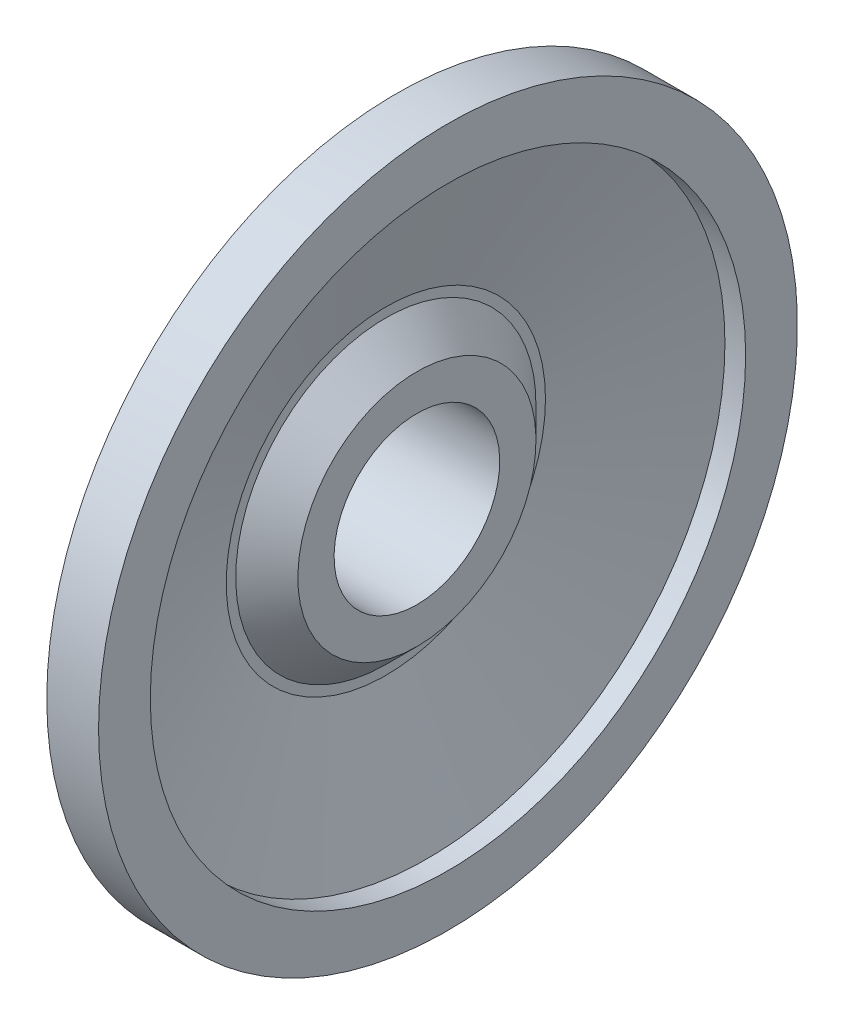
ISO-10303-21;
HEADER;
FILE_DESCRIPTION(('STEP AP214'),'2;1');
FILE_NAME('part.step','',(''),(''),'','','');
FILE_SCHEMA(('AUTOMOTIVE_DESIGN { 1 0 10303 214 1 1 1 1 }'));
ENDSEC;
DATA;
#1=APPLICATION_CONTEXT('core data for automotive mechanical design processes');
#2=APPLICATION_PROTOCOL_DEFINITION('international standard','automotive_design',2000,#1);
#3=PRODUCT_CONTEXT('',#1,'mechanical');
#4=PRODUCT('Part','Part','',(#3));
#5=PRODUCT_RELATED_PRODUCT_CATEGORY('part','',(#4));
#6=PRODUCT_DEFINITION_FORMATION('','',#4);
#7=PRODUCT_DEFINITION_CONTEXT('part definition',#1,'design');
#8=PRODUCT_DEFINITION('design','',#6,#7);
#9=PRODUCT_DEFINITION_SHAPE('','',#8);
#10=(LENGTH_UNIT() NAMED_UNIT(*) SI_UNIT(.MILLI.,.METRE.));
#11=(NAMED_UNIT(*) PLANE_ANGLE_UNIT() SI_UNIT($,.RADIAN.));
#12=(NAMED_UNIT(*) SI_UNIT($,.STERADIAN.) SOLID_ANGLE_UNIT());
#13=UNCERTAINTY_MEASURE_WITH_UNIT(LENGTH_MEASURE(1.E-05),#10,'distance_accuracy_value','');
#14=(GEOMETRIC_REPRESENTATION_CONTEXT(3) GLOBAL_UNCERTAINTY_ASSIGNED_CONTEXT((#13)) GLOBAL_UNIT_ASSIGNED_CONTEXT((#10,
#11,#12)) REPRESENTATION_CONTEXT('',''));
#15=CARTESIAN_POINT('',(0.,0.,0.));
#16=DIRECTION('',(0.,0.,1.));
#17=DIRECTION('',(1.,0.,0.));
#18=AXIS2_PLACEMENT_3D('',#15,#16,#17);
#19=CARTESIAN_POINT('',(-8.,-13.915,13.915));
#20=DIRECTION('',(1.,0.,0.));
#21=DIRECTION('',(0.,0.,-1.));
#22=AXIS2_PLACEMENT_3D('',#19,#20,#21);
#23=PLANE('',#22);
#24=CARTESIAN_POINT('',(-8.,0.,0.));
#25=DIRECTION('',(-1.,0.,0.));
#26=DIRECTION('',(0.,-1.,0.));
#27=AXIS2_PLACEMENT_3D('',#24,#25,#26);
#28=CIRCLE('',#27,8.);
#29=CARTESIAN_POINT('',(-8.,-8.,0.));
#30=VERTEX_POINT('',#29);
#31=EDGE_CURVE('E19',#30,#30,#28,.T.);
#32=ORIENTED_EDGE('',*,*,#31,.F.);
#33=EDGE_LOOP('',(#32));
#34=FACE_BOUND('',#33,.T.);
#35=CARTESIAN_POINT('',(-8.,0.,0.));
#36=DIRECTION('',(-1.,0.,0.));
#37=DIRECTION('',(0.,0.,1.));
#38=AXIS2_PLACEMENT_3D('',#35,#36,#37);
#39=CIRCLE('',#38,13.75);
#40=CARTESIAN_POINT('',(-8.,0.,13.75));
#41=VERTEX_POINT('',#40);
#42=EDGE_CURVE('E50',#41,#41,#39,.T.);
#43=ORIENTED_EDGE('',*,*,#42,.T.);
#44=EDGE_LOOP('',(#43));
#45=FACE_BOUND('',#44,.T.);
#46=ADVANCED_FACE('F15',(#34,#45),#23,.F.);
#47=CARTESIAN_POINT('',(5.,0.,0.));
#48=DIRECTION('',(-1.,0.,0.));
#49=DIRECTION('',(0.,-1.,0.));
#50=AXIS2_PLACEMENT_3D('',#47,#48,#49);
#51=CYLINDRICAL_SURFACE('',#50,8.);
#52=CARTESIAN_POINT('',(5.,0.,0.));
#53=DIRECTION('',(-1.,0.,0.));
#54=DIRECTION('',(0.,-1.,0.));
#55=AXIS2_PLACEMENT_3D('',#52,#53,#54);
#56=CIRCLE('',#55,8.);
#57=CARTESIAN_POINT('',(5.,-8.,0.));
#58=VERTEX_POINT('',#57);
#59=EDGE_CURVE('E38',#58,#58,#56,.F.);
#60=ORIENTED_EDGE('',*,*,#59,.T.);
#61=EDGE_LOOP('',(#60));
#62=FACE_BOUND('',#61,.T.);
#63=ORIENTED_EDGE('',*,*,#31,.T.);
#64=EDGE_LOOP('',(#63));
#65=FACE_BOUND('',#64,.T.);
#66=ADVANCED_FACE('F57',(#62,#65),#51,.F.);
#67=CARTESIAN_POINT('',(-3.,0.,0.));
#68=DIRECTION('',(-1.,0.,0.));
#69=DIRECTION('',(0.,0.,1.));
#70=AXIS2_PLACEMENT_3D('',#67,#68,#69);
#71=CYLINDRICAL_SURFACE('',#70,13.75);
#72=ORIENTED_EDGE('',*,*,#42,.F.);
#73=EDGE_LOOP('',(#72));
#74=FACE_BOUND('',#73,.T.);
#75=CARTESIAN_POINT('',(-3.,0.,0.));
#76=DIRECTION('',(1.,0.,0.));
#77=DIRECTION('',(0.,0.,-1.));
#78=AXIS2_PLACEMENT_3D('',#75,#76,#77);
#79=CIRCLE('',#78,13.75);
#80=CARTESIAN_POINT('',(-3.,0.,-13.75));
#81=VERTEX_POINT('',#80);
#82=EDGE_CURVE('E36',#81,#81,#79,.F.);
#83=ORIENTED_EDGE('',*,*,#82,.T.);
#84=EDGE_LOOP('',(#83));
#85=FACE_BOUND('',#84,.T.);
#86=ADVANCED_FACE('F65',(#74,#85),#71,.T.);
#87=CARTESIAN_POINT('',(5.,-11.638,-11.638));
#88=DIRECTION('',(-1.,0.,0.));
#89=DIRECTION('',(0.,0.,1.));
#90=AXIS2_PLACEMENT_3D('',#87,#88,#89);
#91=PLANE('',#90);
#92=ORIENTED_EDGE('',*,*,#59,.F.);
#93=EDGE_LOOP('',(#92));
#94=FACE_BOUND('',#93,.T.);
#95=CARTESIAN_POINT('',(4.99999999999989,0.,0.));
#96=DIRECTION('',(-1.,0.,0.));
#97=DIRECTION('',(0.,-1.,0.));
#98=AXIS2_PLACEMENT_3D('',#95,#96,#97);
#99=CIRCLE('',#98,11.5000000000001);
#100=CARTESIAN_POINT('',(4.99999999999989,-11.5000000000001,0.));
#101=VERTEX_POINT('',#100);
#102=EDGE_CURVE('E35',#101,#101,#99,.F.);
#103=ORIENTED_EDGE('',*,*,#102,.T.);
#104=EDGE_LOOP('',(#103));
#105=FACE_BOUND('',#104,.T.);
#106=ADVANCED_FACE('F92',(#94,#105),#91,.F.);
#107=CARTESIAN_POINT('',(-3.,0.,0.));
#108=DIRECTION('',(1.,0.,0.));
#109=DIRECTION('',(0.,0.,-1.));
#110=AXIS2_PLACEMENT_3D('',#107,#108,#109);
#111=CONICAL_SURFACE('',#110,13.75,1.27933953231703);
#112=CARTESIAN_POINT('',(3.,0.,0.));
#113=DIRECTION('',(-1.,0.,0.));
#114=DIRECTION('',(0.,0.,1.));
#115=AXIS2_PLACEMENT_3D('',#112,#113,#114);
#116=CIRCLE('',#115,33.75);
#117=CARTESIAN_POINT('',(3.,0.,33.75));
#118=VERTEX_POINT('',#117);
#119=EDGE_CURVE('E31',#118,#118,#116,.T.);
#120=ORIENTED_EDGE('',*,*,#119,.T.);
#121=EDGE_LOOP('',(#120));
#122=FACE_BOUND('',#121,.T.);
#123=ORIENTED_EDGE('',*,*,#82,.F.);
#124=EDGE_LOOP('',(#123));
#125=FACE_BOUND('',#124,.T.);
#126=ADVANCED_FACE('F88',(#122,#125),#111,.T.);
#127=CARTESIAN_POINT('',(5.,0.,0.));
#128=DIRECTION('',(-1.,0.,0.));
#129=DIRECTION('',(0.,-1.,0.));
#130=AXIS2_PLACEMENT_3D('',#127,#128,#129);
#131=CONICAL_SURFACE('',#130,11.5,0.785398163397449);
#132=CARTESIAN_POINT('',(2.,0.,0.));
#133=DIRECTION('',(-1.,0.,0.));
#134=DIRECTION('',(0.,-1.,0.));
#135=AXIS2_PLACEMENT_3D('',#132,#133,#134);
#136=CIRCLE('',#135,14.5);
#137=CARTESIAN_POINT('',(2.,-14.5,0.));
#138=VERTEX_POINT('',#137);
#139=EDGE_CURVE('E34',#138,#138,#136,.F.);
#140=ORIENTED_EDGE('',*,*,#139,.T.);
#141=EDGE_LOOP('',(#140));
#142=FACE_BOUND('',#141,.T.);
#143=ORIENTED_EDGE('',*,*,#102,.F.);
#144=EDGE_LOOP('',(#143));
#145=FACE_BOUND('',#144,.T.);
#146=ADVANCED_FACE('F84',(#142,#145),#131,.T.);
#147=CARTESIAN_POINT('',(8.,0.,0.));
#148=DIRECTION('',(-1.,0.,0.));
#149=DIRECTION('',(0.,0.,1.));
#150=AXIS2_PLACEMENT_3D('',#147,#148,#149);
#151=CYLINDRICAL_SURFACE('',#150,33.75);
#152=ORIENTED_EDGE('',*,*,#119,.F.);
#153=EDGE_LOOP('',(#152));
#154=FACE_BOUND('',#153,.T.);
#155=CARTESIAN_POINT('',(8.,0.,0.));
#156=DIRECTION('',(-1.,0.,0.));
#157=DIRECTION('',(0.,0.,1.));
#158=AXIS2_PLACEMENT_3D('',#155,#156,#157);
#159=CIRCLE('',#158,33.75);
#160=CARTESIAN_POINT('',(8.,0.,33.75));
#161=VERTEX_POINT('',#160);
#162=EDGE_CURVE('E42',#161,#161,#159,.T.);
#163=ORIENTED_EDGE('',*,*,#162,.T.);
#164=EDGE_LOOP('',(#163));
#165=FACE_BOUND('',#164,.T.);
#166=ADVANCED_FACE('F80',(#154,#165),#151,.T.);
#167=CARTESIAN_POINT('',(2.,-15.601666667,-15.601666667));
#168=DIRECTION('',(-1.,0.,0.));
#169=DIRECTION('',(0.,0.,1.));
#170=AXIS2_PLACEMENT_3D('',#167,#168,#169);
#171=PLANE('',#170);
#172=ORIENTED_EDGE('',*,*,#139,.F.);
#173=EDGE_LOOP('',(#172));
#174=FACE_BOUND('',#173,.T.);
#175=CARTESIAN_POINT('',(2.,0.,0.));
#176=DIRECTION('',(1.,0.,0.));
#177=DIRECTION('',(0.,0.,-1.));
#178=AXIS2_PLACEMENT_3D('',#175,#176,#177);
#179=CIRCLE('',#178,15.416666667);
#180=CARTESIAN_POINT('',(2.,0.,-15.416666667));
#181=VERTEX_POINT('',#180);
#182=EDGE_CURVE('E28',#181,#181,#179,.F.);
#183=ORIENTED_EDGE('',*,*,#182,.F.);
#184=EDGE_LOOP('',(#183));
#185=FACE_BOUND('',#184,.T.);
#186=ADVANCED_FACE('F83',(#174,#185),#171,.F.);
#187=CARTESIAN_POINT('',(8.,-34.155,-34.155));
#188=DIRECTION('',(-1.,0.,0.));
#189=DIRECTION('',(0.,0.,1.));
#190=AXIS2_PLACEMENT_3D('',#187,#188,#189);
#191=PLANE('',#190);
#192=CARTESIAN_POINT('',(8.,0.,0.));
#193=DIRECTION('',(-1.,0.,0.));
#194=DIRECTION('',(0.,0.,1.));
#195=AXIS2_PLACEMENT_3D('',#192,#193,#194);
#196=CIRCLE('',#195,28.75);
#197=CARTESIAN_POINT('',(8.,0.,28.75));
#198=VERTEX_POINT('',#197);
#199=EDGE_CURVE('E23',#198,#198,#196,.F.);
#200=ORIENTED_EDGE('',*,*,#199,.F.);
#201=EDGE_LOOP('',(#200));
#202=FACE_BOUND('',#201,.T.);
#203=ORIENTED_EDGE('',*,*,#162,.F.);
#204=EDGE_LOOP('',(#203));
#205=FACE_BOUND('',#204,.T.);
#206=ADVANCED_FACE('F17',(#202,#205),#191,.F.);
#207=CARTESIAN_POINT('',(2.,0.,0.));
#208=DIRECTION('',(1.,0.,0.));
#209=DIRECTION('',(0.,0.,-1.));
#210=AXIS2_PLACEMENT_3D('',#207,#208,#209);
#211=CONICAL_SURFACE('',#210,15.416666667,1.27933953231015);
#212=CARTESIAN_POINT('',(6.,0.,0.));
#213=DIRECTION('',(-1.,0.,0.));
#214=DIRECTION('',(0.,0.,1.));
#215=AXIS2_PLACEMENT_3D('',#212,#213,#214);
#216=CIRCLE('',#215,28.75);
#217=CARTESIAN_POINT('',(6.,0.,28.75));
#218=VERTEX_POINT('',#217);
#219=EDGE_CURVE('E10',#218,#218,#216,.T.);
#220=ORIENTED_EDGE('',*,*,#219,.F.);
#221=EDGE_LOOP('',(#220));
#222=FACE_BOUND('',#221,.T.);
#223=ORIENTED_EDGE('',*,*,#182,.T.);
#224=EDGE_LOOP('',(#223));
#225=FACE_BOUND('',#224,.T.);
#226=ADVANCED_FACE('F71',(#222,#225),#211,.F.);
#227=CARTESIAN_POINT('',(8.,0.,0.));
#228=DIRECTION('',(-1.,0.,0.));
#229=DIRECTION('',(0.,0.,1.));
#230=AXIS2_PLACEMENT_3D('',#227,#228,#229);
#231=CYLINDRICAL_SURFACE('',#230,28.75);
#232=ORIENTED_EDGE('',*,*,#219,.T.);
#233=EDGE_LOOP('',(#232));
#234=FACE_BOUND('',#233,.T.);
#235=ORIENTED_EDGE('',*,*,#199,.T.);
#236=EDGE_LOOP('',(#235));
#237=FACE_BOUND('',#236,.T.);
#238=ADVANCED_FACE('F69',(#234,#237),#231,.F.);
#239=CLOSED_SHELL('',(#46,#66,#86,#106,#126,#146,#166,#186,#206,#226,#238));
#240=MANIFOLD_SOLID_BREP('B1',#239);
#241=ADVANCED_BREP_SHAPE_REPRESENTATION('',(#18,#240),#14);
#242=SHAPE_DEFINITION_REPRESENTATION(#9,#241);
ENDSEC;
END-ISO-10303-21;
